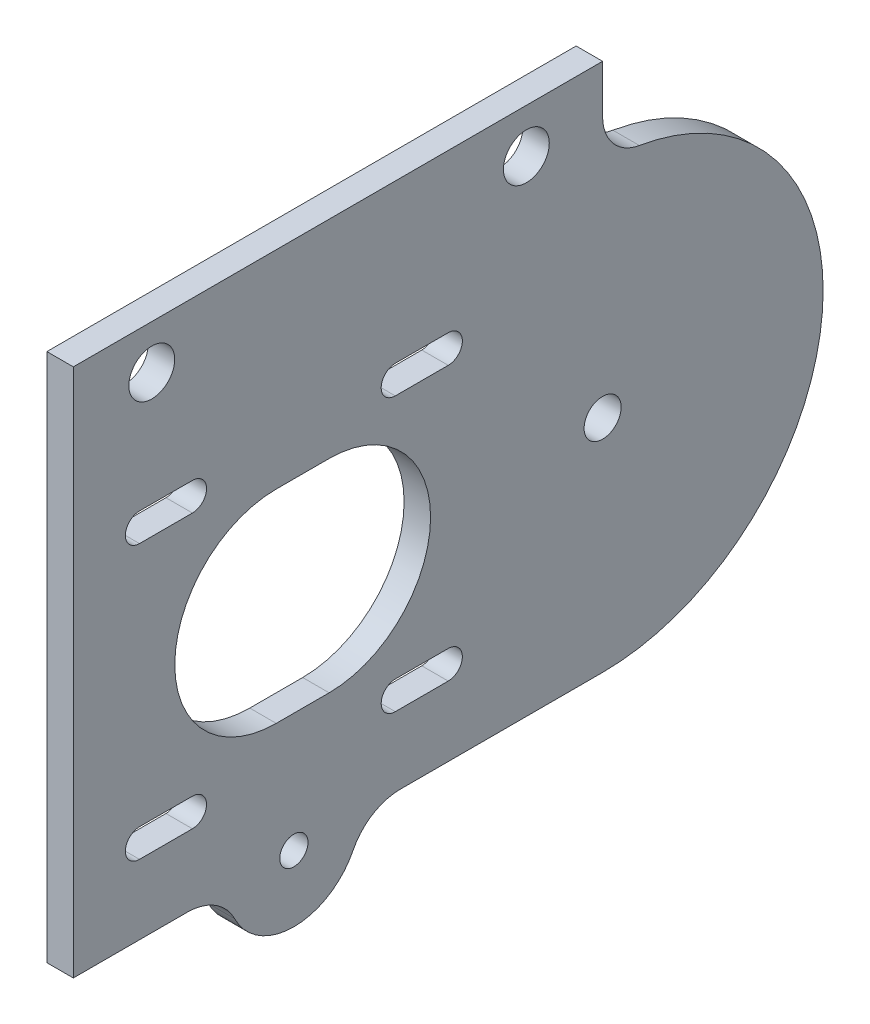
ISO-10303-21;
HEADER;
FILE_DESCRIPTION(('STEP AP214'),'2;1');
FILE_NAME('part.step','',(''),(''),'','','');
FILE_SCHEMA(('AUTOMOTIVE_DESIGN { 1 0 10303 214 1 1 1 1 }'));
ENDSEC;
DATA;
#1=APPLICATION_CONTEXT('core data for automotive mechanical design processes');
#2=APPLICATION_PROTOCOL_DEFINITION('international standard','automotive_design',2000,#1);
#3=PRODUCT_CONTEXT('',#1,'mechanical');
#4=PRODUCT('Part','Part','',(#3));
#5=PRODUCT_RELATED_PRODUCT_CATEGORY('part','',(#4));
#6=PRODUCT_DEFINITION_FORMATION('','',#4);
#7=PRODUCT_DEFINITION_CONTEXT('part definition',#1,'design');
#8=PRODUCT_DEFINITION('design','',#6,#7);
#9=PRODUCT_DEFINITION_SHAPE('','',#8);
#10=(LENGTH_UNIT() NAMED_UNIT(*) SI_UNIT(.MILLI.,.METRE.));
#11=(NAMED_UNIT(*) PLANE_ANGLE_UNIT() SI_UNIT($,.RADIAN.));
#12=(NAMED_UNIT(*) SI_UNIT($,.STERADIAN.) SOLID_ANGLE_UNIT());
#13=UNCERTAINTY_MEASURE_WITH_UNIT(LENGTH_MEASURE(1.E-05),#10,'distance_accuracy_value','');
#14=(GEOMETRIC_REPRESENTATION_CONTEXT(3) GLOBAL_UNCERTAINTY_ASSIGNED_CONTEXT((#13)) GLOBAL_UNIT_ASSIGNED_CONTEXT((#10,
#11,#12)) REPRESENTATION_CONTEXT('',''));
#15=CARTESIAN_POINT('',(0.,0.,0.));
#16=DIRECTION('',(0.,0.,1.));
#17=DIRECTION('',(1.,0.,0.));
#18=AXIS2_PLACEMENT_3D('',#15,#16,#17);
#19=CARTESIAN_POINT('',(3.,-25.,0.));
#20=DIRECTION('',(0.,1.,0.));
#21=DIRECTION('',(0.,0.,1.));
#22=AXIS2_PLACEMENT_3D('',#19,#20,#21);
#23=PLANE('',#22);
#24=DIRECTION('',(0.,0.,-1.));
#25=VECTOR('',#24,1.);
#26=CARTESIAN_POINT('',(0.,-25.,0.));
#27=LINE('',#26,#25);
#28=CARTESIAN_POINT('',(0.,-25.,25.));
#29=VERTEX_POINT('',#28);
#30=CARTESIAN_POINT('',(0.,-25.,12.0834392290772));
#31=VERTEX_POINT('',#30);
#32=EDGE_CURVE('E338',#29,#31,#27,.T.);
#33=ORIENTED_EDGE('',*,*,#32,.T.);
#34=DIRECTION('',(1.,0.,0.));
#35=VECTOR('',#34,1.);
#36=CARTESIAN_POINT('',(3.,-25.,12.0834392290772));
#37=LINE('',#36,#35);
#38=CARTESIAN_POINT('',(3.,-25.,12.0834392290772));
#39=VERTEX_POINT('',#38);
#40=EDGE_CURVE('E469',#31,#39,#37,.T.);
#41=ORIENTED_EDGE('',*,*,#40,.T.);
#42=DIRECTION('',(0.,0.,-1.));
#43=VECTOR('',#42,1.);
#44=CARTESIAN_POINT('',(3.,-25.,0.));
#45=LINE('',#44,#43);
#46=CARTESIAN_POINT('',(3.,-25.,25.));
#47=VERTEX_POINT('',#46);
#48=EDGE_CURVE('E271',#47,#39,#45,.T.);
#49=ORIENTED_EDGE('',*,*,#48,.F.);
#50=DIRECTION('',(-1.,0.,0.));
#51=VECTOR('',#50,1.);
#52=CARTESIAN_POINT('',(3.,-25.,25.));
#53=LINE('',#52,#51);
#54=EDGE_CURVE('E337',#47,#29,#53,.T.);
#55=ORIENTED_EDGE('',*,*,#54,.T.);
#56=EDGE_LOOP('',(#33,#41,#49,#55));
#57=FACE_BOUND('',#56,.T.);
#58=ADVANCED_FACE('F34',(#57),#23,.F.);
#59=CARTESIAN_POINT('',(3.,-13.9,0.));
#60=DIRECTION('',(0.,1.,0.));
#61=DIRECTION('',(0.,0.,1.));
#62=AXIS2_PLACEMENT_3D('',#59,#60,#61);
#63=PLANE('',#62);
#64=DIRECTION('',(0.,0.,-1.));
#65=VECTOR('',#64,1.);
#66=CARTESIAN_POINT('',(0.,-13.9,0.));
#67=LINE('',#66,#65);
#68=CARTESIAN_POINT('',(0.,-13.9,17.5));
#69=VERTEX_POINT('',#68);
#70=CARTESIAN_POINT('',(0.,-13.9,11.5));
#71=VERTEX_POINT('',#70);
#72=EDGE_CURVE('E392',#69,#71,#67,.T.);
#73=ORIENTED_EDGE('',*,*,#72,.T.);
#74=DIRECTION('',(-1.,0.,0.));
#75=VECTOR('',#74,1.);
#76=CARTESIAN_POINT('',(3.,-13.9,11.5));
#77=LINE('',#76,#75);
#78=CARTESIAN_POINT('',(3.,-13.9,11.5));
#79=VERTEX_POINT('',#78);
#80=EDGE_CURVE('E414',#79,#71,#77,.T.);
#81=ORIENTED_EDGE('',*,*,#80,.F.);
#82=DIRECTION('',(0.,0.,-1.));
#83=VECTOR('',#82,1.);
#84=CARTESIAN_POINT('',(3.,-13.9,0.));
#85=LINE('',#84,#83);
#86=CARTESIAN_POINT('',(3.,-13.9,17.5));
#87=VERTEX_POINT('',#86);
#88=EDGE_CURVE('E324',#87,#79,#85,.T.);
#89=ORIENTED_EDGE('',*,*,#88,.F.);
#90=DIRECTION('',(-1.,0.,0.));
#91=VECTOR('',#90,1.);
#92=CARTESIAN_POINT('',(3.,-13.9,17.5));
#93=LINE('',#92,#91);
#94=EDGE_CURVE('E406',#87,#69,#93,.T.);
#95=ORIENTED_EDGE('',*,*,#94,.T.);
#96=EDGE_LOOP('',(#73,#81,#89,#95));
#97=FACE_BOUND('',#96,.T.);
#98=ADVANCED_FACE('F512',(#97),#63,.F.);
#99=CARTESIAN_POINT('',(3.,-15.5,11.5));
#100=DIRECTION('',(-1.,0.,0.));
#101=DIRECTION('',(0.,0.,1.));
#102=AXIS2_PLACEMENT_3D('',#99,#100,#101);
#103=CYLINDRICAL_SURFACE('',#102,1.6);
#104=CARTESIAN_POINT('',(0.,-15.5,11.5));
#105=DIRECTION('',(1.,0.,0.));
#106=DIRECTION('',(0.,0.,-1.));
#107=AXIS2_PLACEMENT_3D('',#104,#105,#106);
#108=CIRCLE('',#107,1.6);
#109=CARTESIAN_POINT('',(0.,-17.1,11.5));
#110=VERTEX_POINT('',#109);
#111=EDGE_CURVE('E395',#71,#110,#108,.F.);
#112=ORIENTED_EDGE('',*,*,#111,.T.);
#113=DIRECTION('',(-1.,0.,0.));
#114=VECTOR('',#113,1.);
#115=CARTESIAN_POINT('',(3.,-17.1,11.5));
#116=LINE('',#115,#114);
#117=CARTESIAN_POINT('',(3.,-17.1,11.5));
#118=VERTEX_POINT('',#117);
#119=EDGE_CURVE('E412',#118,#110,#116,.T.);
#120=ORIENTED_EDGE('',*,*,#119,.F.);
#121=CARTESIAN_POINT('',(3.,-15.5,11.5));
#122=DIRECTION('',(1.,0.,0.));
#123=DIRECTION('',(0.,0.,-1.));
#124=AXIS2_PLACEMENT_3D('',#121,#122,#123);
#125=CIRCLE('',#124,1.6);
#126=EDGE_CURVE('E327',#79,#118,#125,.F.);
#127=ORIENTED_EDGE('',*,*,#126,.F.);
#128=ORIENTED_EDGE('',*,*,#80,.T.);
#129=EDGE_LOOP('',(#112,#120,#127,#128));
#130=FACE_BOUND('',#129,.T.);
#131=ADVANCED_FACE('F519',(#130),#103,.F.);
#132=CARTESIAN_POINT('',(3.,-17.1,0.));
#133=DIRECTION('',(0.,1.,0.));
#134=DIRECTION('',(0.,0.,1.));
#135=AXIS2_PLACEMENT_3D('',#132,#133,#134);
#136=PLANE('',#135);
#137=DIRECTION('',(0.,0.,-1.));
#138=VECTOR('',#137,1.);
#139=CARTESIAN_POINT('',(0.,-17.1,0.));
#140=LINE('',#139,#138);
#141=CARTESIAN_POINT('',(0.,-17.1,17.5));
#142=VERTEX_POINT('',#141);
#143=EDGE_CURVE('E398',#142,#110,#140,.T.);
#144=ORIENTED_EDGE('',*,*,#143,.F.);
#145=DIRECTION('',(-1.,0.,0.));
#146=VECTOR('',#145,1.);
#147=CARTESIAN_POINT('',(3.,-17.1,17.5));
#148=LINE('',#147,#146);
#149=CARTESIAN_POINT('',(3.,-17.1,17.5));
#150=VERTEX_POINT('',#149);
#151=EDGE_CURVE('E409',#150,#142,#148,.T.);
#152=ORIENTED_EDGE('',*,*,#151,.F.);
#153=DIRECTION('',(0.,0.,-1.));
#154=VECTOR('',#153,1.);
#155=CARTESIAN_POINT('',(3.,-17.1,0.));
#156=LINE('',#155,#154);
#157=EDGE_CURVE('E329',#150,#118,#156,.T.);
#158=ORIENTED_EDGE('',*,*,#157,.T.);
#159=ORIENTED_EDGE('',*,*,#119,.T.);
#160=EDGE_LOOP('',(#144,#152,#158,#159));
#161=FACE_BOUND('',#160,.T.);
#162=ADVANCED_FACE('F624',(#161),#136,.T.);
#163=CARTESIAN_POINT('',(3.,15.5,11.5));
#164=DIRECTION('',(-1.,0.,0.));
#165=DIRECTION('',(0.,0.,1.));
#166=AXIS2_PLACEMENT_3D('',#163,#164,#165);
#167=CYLINDRICAL_SURFACE('',#166,1.6);
#168=CARTESIAN_POINT('',(0.,15.5,11.5));
#169=DIRECTION('',(1.,0.,0.));
#170=DIRECTION('',(0.,0.,-1.));
#171=AXIS2_PLACEMENT_3D('',#168,#169,#170);
#172=CIRCLE('',#171,1.6);
#173=CARTESIAN_POINT('',(0.,13.9,11.5));
#174=VERTEX_POINT('',#173);
#175=CARTESIAN_POINT('',(0.,17.1,11.5));
#176=VERTEX_POINT('',#175);
#177=EDGE_CURVE('E380',#174,#176,#172,.T.);
#178=ORIENTED_EDGE('',*,*,#177,.F.);
#179=DIRECTION('',(-1.,0.,0.));
#180=VECTOR('',#179,1.);
#181=CARTESIAN_POINT('',(3.,13.9,11.5));
#182=LINE('',#181,#180);
#183=CARTESIAN_POINT('',(3.,13.9,11.5));
#184=VERTEX_POINT('',#183);
#185=EDGE_CURVE('E410',#184,#174,#182,.T.);
#186=ORIENTED_EDGE('',*,*,#185,.F.);
#187=CARTESIAN_POINT('',(3.,15.5,11.5));
#188=DIRECTION('',(1.,0.,0.));
#189=DIRECTION('',(0.,0.,-1.));
#190=AXIS2_PLACEMENT_3D('',#187,#188,#189);
#191=CIRCLE('',#190,1.6);
#192=CARTESIAN_POINT('',(3.,17.1,11.5));
#193=VERTEX_POINT('',#192);
#194=EDGE_CURVE('E313',#184,#193,#191,.T.);
#195=ORIENTED_EDGE('',*,*,#194,.T.);
#196=DIRECTION('',(-1.,0.,0.));
#197=VECTOR('',#196,1.);
#198=CARTESIAN_POINT('',(3.,17.1,11.5));
#199=LINE('',#198,#197);
#200=EDGE_CURVE('E417',#193,#176,#199,.T.);
#201=ORIENTED_EDGE('',*,*,#200,.T.);
#202=EDGE_LOOP('',(#178,#186,#195,#201));
#203=FACE_BOUND('',#202,.T.);
#204=ADVANCED_FACE('F627',(#203),#167,.F.);
#205=CARTESIAN_POINT('',(3.,13.9,0.));
#206=DIRECTION('',(0.,1.,0.));
#207=DIRECTION('',(0.,0.,1.));
#208=AXIS2_PLACEMENT_3D('',#205,#206,#207);
#209=PLANE('',#208);
#210=DIRECTION('',(0.,0.,-1.));
#211=VECTOR('',#210,1.);
#212=CARTESIAN_POINT('',(0.,13.9,0.));
#213=LINE('',#212,#211);
#214=CARTESIAN_POINT('',(0.,13.9,17.5));
#215=VERTEX_POINT('',#214);
#216=EDGE_CURVE('E383',#215,#174,#213,.T.);
#217=ORIENTED_EDGE('',*,*,#216,.F.);
#218=DIRECTION('',(-1.,0.,0.));
#219=VECTOR('',#218,1.);
#220=CARTESIAN_POINT('',(3.,13.9,17.5));
#221=LINE('',#220,#219);
#222=CARTESIAN_POINT('',(3.,13.9,17.5));
#223=VERTEX_POINT('',#222);
#224=EDGE_CURVE('E422',#223,#215,#221,.T.);
#225=ORIENTED_EDGE('',*,*,#224,.F.);
#226=DIRECTION('',(0.,0.,-1.));
#227=VECTOR('',#226,1.);
#228=CARTESIAN_POINT('',(3.,13.9,0.));
#229=LINE('',#228,#227);
#230=EDGE_CURVE('E316',#223,#184,#229,.T.);
#231=ORIENTED_EDGE('',*,*,#230,.T.);
#232=ORIENTED_EDGE('',*,*,#185,.T.);
#233=EDGE_LOOP('',(#217,#225,#231,#232));
#234=FACE_BOUND('',#233,.T.);
#235=ADVANCED_FACE('F639',(#234),#209,.T.);
#236=CARTESIAN_POINT('',(3.,15.5,17.5));
#237=DIRECTION('',(-1.,0.,0.));
#238=DIRECTION('',(0.,0.,1.));
#239=AXIS2_PLACEMENT_3D('',#236,#237,#238);
#240=CYLINDRICAL_SURFACE('',#239,1.6);
#241=CARTESIAN_POINT('',(0.,15.5,17.5));
#242=DIRECTION('',(1.,0.,0.));
#243=DIRECTION('',(0.,0.,-1.));
#244=AXIS2_PLACEMENT_3D('',#241,#242,#243);
#245=CIRCLE('',#244,1.6);
#246=CARTESIAN_POINT('',(0.,17.1,17.5));
#247=VERTEX_POINT('',#246);
#248=EDGE_CURVE('E386',#247,#215,#245,.T.);
#249=ORIENTED_EDGE('',*,*,#248,.F.);
#250=DIRECTION('',(-1.,0.,0.));
#251=VECTOR('',#250,1.);
#252=CARTESIAN_POINT('',(3.,17.1,17.5));
#253=LINE('',#252,#251);
#254=CARTESIAN_POINT('',(3.,17.1,17.5));
#255=VERTEX_POINT('',#254);
#256=EDGE_CURVE('E419',#255,#247,#253,.T.);
#257=ORIENTED_EDGE('',*,*,#256,.F.);
#258=CARTESIAN_POINT('',(3.,15.5,17.5));
#259=DIRECTION('',(1.,0.,0.));
#260=DIRECTION('',(0.,0.,-1.));
#261=AXIS2_PLACEMENT_3D('',#258,#259,#260);
#262=CIRCLE('',#261,1.6);
#263=EDGE_CURVE('E319',#255,#223,#262,.T.);
#264=ORIENTED_EDGE('',*,*,#263,.T.);
#265=ORIENTED_EDGE('',*,*,#224,.T.);
#266=EDGE_LOOP('',(#249,#257,#264,#265));
#267=FACE_BOUND('',#266,.T.);
#268=ADVANCED_FACE('F635',(#267),#240,.F.);
#269=CARTESIAN_POINT('',(3.,-15.5,-17.5));
#270=DIRECTION('',(-1.,0.,0.));
#271=DIRECTION('',(0.,0.,1.));
#272=AXIS2_PLACEMENT_3D('',#269,#270,#271);
#273=CYLINDRICAL_SURFACE('',#272,1.6);
#274=CARTESIAN_POINT('',(0.,-15.5,-17.5));
#275=DIRECTION('',(1.,0.,0.));
#276=DIRECTION('',(0.,0.,-1.));
#277=AXIS2_PLACEMENT_3D('',#274,#275,#276);
#278=CIRCLE('',#277,1.6);
#279=CARTESIAN_POINT('',(0.,-17.1,-17.5));
#280=VERTEX_POINT('',#279);
#281=CARTESIAN_POINT('',(0.,-13.9,-17.5));
#282=VERTEX_POINT('',#281);
#283=EDGE_CURVE('E368',#280,#282,#278,.T.);
#284=ORIENTED_EDGE('',*,*,#283,.F.);
#285=DIRECTION('',(-1.,0.,0.));
#286=VECTOR('',#285,1.);
#287=CARTESIAN_POINT('',(3.,-17.1,-17.5));
#288=LINE('',#287,#286);
#289=CARTESIAN_POINT('',(3.,-17.1,-17.5));
#290=VERTEX_POINT('',#289);
#291=EDGE_CURVE('E420',#290,#280,#288,.T.);
#292=ORIENTED_EDGE('',*,*,#291,.F.);
#293=CARTESIAN_POINT('',(3.,-15.5,-17.5));
#294=DIRECTION('',(1.,0.,0.));
#295=DIRECTION('',(0.,0.,-1.));
#296=AXIS2_PLACEMENT_3D('',#293,#294,#295);
#297=CIRCLE('',#296,1.6);
#298=CARTESIAN_POINT('',(3.,-13.9,-17.5));
#299=VERTEX_POINT('',#298);
#300=EDGE_CURVE('E302',#290,#299,#297,.T.);
#301=ORIENTED_EDGE('',*,*,#300,.T.);
#302=DIRECTION('',(-1.,0.,0.));
#303=VECTOR('',#302,1.);
#304=CARTESIAN_POINT('',(3.,-13.9,-17.5));
#305=LINE('',#304,#303);
#306=EDGE_CURVE('E425',#299,#282,#305,.T.);
#307=ORIENTED_EDGE('',*,*,#306,.T.);
#308=EDGE_LOOP('',(#284,#292,#301,#307));
#309=FACE_BOUND('',#308,.T.);
#310=ADVANCED_FACE('F638',(#309),#273,.F.);
#311=CARTESIAN_POINT('',(3.,-17.1,0.));
#312=DIRECTION('',(0.,-1.,0.));
#313=DIRECTION('',(0.,0.,-1.));
#314=AXIS2_PLACEMENT_3D('',#311,#312,#313);
#315=PLANE('',#314);
#316=DIRECTION('',(0.,0.,1.));
#317=VECTOR('',#316,1.);
#318=CARTESIAN_POINT('',(0.,-17.1,0.));
#319=LINE('',#318,#317);
#320=CARTESIAN_POINT('',(0.,-17.1,-11.5));
#321=VERTEX_POINT('',#320);
#322=EDGE_CURVE('E371',#280,#321,#319,.T.);
#323=ORIENTED_EDGE('',*,*,#322,.T.);
#324=DIRECTION('',(-1.,0.,0.));
#325=VECTOR('',#324,1.);
#326=CARTESIAN_POINT('',(3.,-17.1,-11.5));
#327=LINE('',#326,#325);
#328=CARTESIAN_POINT('',(3.,-17.1,-11.5));
#329=VERTEX_POINT('',#328);
#330=EDGE_CURVE('E430',#329,#321,#327,.T.);
#331=ORIENTED_EDGE('',*,*,#330,.F.);
#332=DIRECTION('',(0.,0.,1.));
#333=VECTOR('',#332,1.);
#334=CARTESIAN_POINT('',(3.,-17.1,0.));
#335=LINE('',#334,#333);
#336=EDGE_CURVE('E305',#290,#329,#335,.T.);
#337=ORIENTED_EDGE('',*,*,#336,.F.);
#338=ORIENTED_EDGE('',*,*,#291,.T.);
#339=EDGE_LOOP('',(#323,#331,#337,#338));
#340=FACE_BOUND('',#339,.T.);
#341=ADVANCED_FACE('F654',(#340),#315,.F.);
#342=CARTESIAN_POINT('',(3.,-15.5,-11.5));
#343=DIRECTION('',(-1.,0.,0.));
#344=DIRECTION('',(0.,0.,1.));
#345=AXIS2_PLACEMENT_3D('',#342,#343,#344);
#346=CYLINDRICAL_SURFACE('',#345,1.6);
#347=CARTESIAN_POINT('',(0.,-15.5,-11.5));
#348=DIRECTION('',(1.,0.,0.));
#349=DIRECTION('',(0.,0.,-1.));
#350=AXIS2_PLACEMENT_3D('',#347,#348,#349);
#351=CIRCLE('',#350,1.6);
#352=CARTESIAN_POINT('',(0.,-13.9,-11.5));
#353=VERTEX_POINT('',#352);
#354=EDGE_CURVE('E374',#353,#321,#351,.T.);
#355=ORIENTED_EDGE('',*,*,#354,.F.);
#356=DIRECTION('',(-1.,0.,0.));
#357=VECTOR('',#356,1.);
#358=CARTESIAN_POINT('',(3.,-13.9,-11.5));
#359=LINE('',#358,#357);
#360=CARTESIAN_POINT('',(3.,-13.9,-11.5));
#361=VERTEX_POINT('',#360);
#362=EDGE_CURVE('E427',#361,#353,#359,.T.);
#363=ORIENTED_EDGE('',*,*,#362,.F.);
#364=CARTESIAN_POINT('',(3.,-15.5,-11.5));
#365=DIRECTION('',(1.,0.,0.));
#366=DIRECTION('',(0.,0.,-1.));
#367=AXIS2_PLACEMENT_3D('',#364,#365,#366);
#368=CIRCLE('',#367,1.6);
#369=EDGE_CURVE('E307',#361,#329,#368,.T.);
#370=ORIENTED_EDGE('',*,*,#369,.T.);
#371=ORIENTED_EDGE('',*,*,#330,.T.);
#372=EDGE_LOOP('',(#355,#363,#370,#371));
#373=FACE_BOUND('',#372,.T.);
#374=ADVANCED_FACE('F650',(#373),#346,.F.);
#375=CARTESIAN_POINT('',(3.,17.1,0.));
#376=DIRECTION('',(0.,-1.,0.));
#377=DIRECTION('',(0.,0.,-1.));
#378=AXIS2_PLACEMENT_3D('',#375,#376,#377);
#379=PLANE('',#378);
#380=DIRECTION('',(0.,0.,1.));
#381=VECTOR('',#380,1.);
#382=CARTESIAN_POINT('',(0.,17.1,0.));
#383=LINE('',#382,#381);
#384=CARTESIAN_POINT('',(0.,17.1,-17.5));
#385=VERTEX_POINT('',#384);
#386=CARTESIAN_POINT('',(0.,17.1,-11.5));
#387=VERTEX_POINT('',#386);
#388=EDGE_CURVE('E356',#385,#387,#383,.T.);
#389=ORIENTED_EDGE('',*,*,#388,.F.);
#390=DIRECTION('',(-1.,0.,0.));
#391=VECTOR('',#390,1.);
#392=CARTESIAN_POINT('',(3.,17.1,-17.5));
#393=LINE('',#392,#391);
#394=CARTESIAN_POINT('',(3.,17.1,-17.5));
#395=VERTEX_POINT('',#394);
#396=EDGE_CURVE('E428',#395,#385,#393,.T.);
#397=ORIENTED_EDGE('',*,*,#396,.F.);
#398=DIRECTION('',(0.,0.,1.));
#399=VECTOR('',#398,1.);
#400=CARTESIAN_POINT('',(3.,17.1,0.));
#401=LINE('',#400,#399);
#402=CARTESIAN_POINT('',(3.,17.1,-11.5));
#403=VERTEX_POINT('',#402);
#404=EDGE_CURVE('E291',#395,#403,#401,.T.);
#405=ORIENTED_EDGE('',*,*,#404,.T.);
#406=DIRECTION('',(-1.,0.,0.));
#407=VECTOR('',#406,1.);
#408=CARTESIAN_POINT('',(3.,17.1,-11.5));
#409=LINE('',#408,#407);
#410=EDGE_CURVE('E433',#403,#387,#409,.T.);
#411=ORIENTED_EDGE('',*,*,#410,.T.);
#412=EDGE_LOOP('',(#389,#397,#405,#411));
#413=FACE_BOUND('',#412,.T.);
#414=ADVANCED_FACE('F653',(#413),#379,.T.);
#415=CARTESIAN_POINT('',(3.,15.5,-17.5));
#416=DIRECTION('',(-1.,0.,0.));
#417=DIRECTION('',(0.,0.,1.));
#418=AXIS2_PLACEMENT_3D('',#415,#416,#417);
#419=CYLINDRICAL_SURFACE('',#418,1.6);
#420=CARTESIAN_POINT('',(0.,15.5,-17.5));
#421=DIRECTION('',(1.,0.,0.));
#422=DIRECTION('',(0.,0.,-1.));
#423=AXIS2_PLACEMENT_3D('',#420,#421,#422);
#424=CIRCLE('',#423,1.6);
#425=CARTESIAN_POINT('',(0.,13.9,-17.5));
#426=VERTEX_POINT('',#425);
#427=EDGE_CURVE('E359',#385,#426,#424,.F.);
#428=ORIENTED_EDGE('',*,*,#427,.T.);
#429=DIRECTION('',(-1.,0.,0.));
#430=VECTOR('',#429,1.);
#431=CARTESIAN_POINT('',(3.,13.9,-17.5));
#432=LINE('',#431,#430);
#433=CARTESIAN_POINT('',(3.,13.9,-17.5));
#434=VERTEX_POINT('',#433);
#435=EDGE_CURVE('E439',#434,#426,#432,.T.);
#436=ORIENTED_EDGE('',*,*,#435,.F.);
#437=CARTESIAN_POINT('',(3.,15.5,-17.5));
#438=DIRECTION('',(1.,0.,0.));
#439=DIRECTION('',(0.,0.,-1.));
#440=AXIS2_PLACEMENT_3D('',#437,#438,#439);
#441=CIRCLE('',#440,1.6);
#442=EDGE_CURVE('E294',#395,#434,#441,.F.);
#443=ORIENTED_EDGE('',*,*,#442,.F.);
#444=ORIENTED_EDGE('',*,*,#396,.T.);
#445=EDGE_LOOP('',(#428,#436,#443,#444));
#446=FACE_BOUND('',#445,.T.);
#447=ADVANCED_FACE('F664',(#446),#419,.F.);
#448=CARTESIAN_POINT('',(3.,13.9,0.));
#449=DIRECTION('',(0.,-1.,0.));
#450=DIRECTION('',(0.,0.,-1.));
#451=AXIS2_PLACEMENT_3D('',#448,#449,#450);
#452=PLANE('',#451);
#453=DIRECTION('',(0.,0.,1.));
#454=VECTOR('',#453,1.);
#455=CARTESIAN_POINT('',(0.,13.9,0.));
#456=LINE('',#455,#454);
#457=CARTESIAN_POINT('',(0.,13.9,-11.5));
#458=VERTEX_POINT('',#457);
#459=EDGE_CURVE('E362',#426,#458,#456,.T.);
#460=ORIENTED_EDGE('',*,*,#459,.T.);
#461=DIRECTION('',(-1.,0.,0.));
#462=VECTOR('',#461,1.);
#463=CARTESIAN_POINT('',(3.,13.9,-11.5));
#464=LINE('',#463,#462);
#465=CARTESIAN_POINT('',(3.,13.9,-11.5));
#466=VERTEX_POINT('',#465);
#467=EDGE_CURVE('E435',#466,#458,#464,.T.);
#468=ORIENTED_EDGE('',*,*,#467,.F.);
#469=DIRECTION('',(0.,0.,1.));
#470=VECTOR('',#469,1.);
#471=CARTESIAN_POINT('',(3.,13.9,0.));
#472=LINE('',#471,#470);
#473=EDGE_CURVE('E297',#434,#466,#472,.T.);
#474=ORIENTED_EDGE('',*,*,#473,.F.);
#475=ORIENTED_EDGE('',*,*,#435,.T.);
#476=EDGE_LOOP('',(#460,#468,#474,#475));
#477=FACE_BOUND('',#476,.T.);
#478=ADVANCED_FACE('F546',(#477),#452,.F.);
#479=CARTESIAN_POINT('',(3.,0.,-4.));
#480=DIRECTION('',(-1.,0.,0.));
#481=DIRECTION('',(0.,0.,1.));
#482=AXIS2_PLACEMENT_3D('',#479,#480,#481);
#483=CYLINDRICAL_SURFACE('',#482,11.5);
#484=CARTESIAN_POINT('',(0.,0.,-4.));
#485=DIRECTION('',(1.,0.,0.));
#486=DIRECTION('',(0.,0.,-1.));
#487=AXIS2_PLACEMENT_3D('',#484,#485,#486);
#488=CIRCLE('',#487,11.5);
#489=CARTESIAN_POINT('',(0.,-11.5,-4.));
#490=VERTEX_POINT('',#489);
#491=CARTESIAN_POINT('',(0.,11.5,-4.));
#492=VERTEX_POINT('',#491);
#493=EDGE_CURVE('E344',#490,#492,#488,.T.);
#494=ORIENTED_EDGE('',*,*,#493,.F.);
#495=DIRECTION('',(-1.,0.,0.));
#496=VECTOR('',#495,1.);
#497=CARTESIAN_POINT('',(3.,-11.5,-4.));
#498=LINE('',#497,#496);
#499=CARTESIAN_POINT('',(3.,-11.5,-4.));
#500=VERTEX_POINT('',#499);
#501=EDGE_CURVE('E436',#500,#490,#498,.T.);
#502=ORIENTED_EDGE('',*,*,#501,.F.);
#503=CARTESIAN_POINT('',(3.,0.,-4.));
#504=DIRECTION('',(1.,0.,0.));
#505=DIRECTION('',(0.,0.,-1.));
#506=AXIS2_PLACEMENT_3D('',#503,#504,#505);
#507=CIRCLE('',#506,11.5);
#508=CARTESIAN_POINT('',(3.,11.5,-4.));
#509=VERTEX_POINT('',#508);
#510=EDGE_CURVE('E280',#500,#509,#507,.T.);
#511=ORIENTED_EDGE('',*,*,#510,.T.);
#512=DIRECTION('',(-1.,0.,0.));
#513=VECTOR('',#512,1.);
#514=CARTESIAN_POINT('',(3.,11.5,-4.));
#515=LINE('',#514,#513);
#516=EDGE_CURVE('E443',#509,#492,#515,.T.);
#517=ORIENTED_EDGE('',*,*,#516,.T.);
#518=EDGE_LOOP('',(#494,#502,#511,#517));
#519=FACE_BOUND('',#518,.T.);
#520=ADVANCED_FACE('F536',(#519),#483,.F.);
#521=CARTESIAN_POINT('',(3.,-11.5,0.));
#522=DIRECTION('',(0.,1.,0.));
#523=DIRECTION('',(0.,0.,1.));
#524=AXIS2_PLACEMENT_3D('',#521,#522,#523);
#525=PLANE('',#524);
#526=DIRECTION('',(0.,0.,-1.));
#527=VECTOR('',#526,1.);
#528=CARTESIAN_POINT('',(0.,-11.5,0.));
#529=LINE('',#528,#527);
#530=CARTESIAN_POINT('',(0.,-11.5,2.));
#531=VERTEX_POINT('',#530);
#532=EDGE_CURVE('E347',#531,#490,#529,.T.);
#533=ORIENTED_EDGE('',*,*,#532,.F.);
#534=DIRECTION('',(-1.,0.,0.));
#535=VECTOR('',#534,1.);
#536=CARTESIAN_POINT('',(3.,-11.5,2.));
#537=LINE('',#536,#535);
#538=CARTESIAN_POINT('',(3.,-11.5,2.));
#539=VERTEX_POINT('',#538);
#540=EDGE_CURVE('E448',#539,#531,#537,.T.);
#541=ORIENTED_EDGE('',*,*,#540,.F.);
#542=DIRECTION('',(0.,0.,-1.));
#543=VECTOR('',#542,1.);
#544=CARTESIAN_POINT('',(3.,-11.5,0.));
#545=LINE('',#544,#543);
#546=EDGE_CURVE('E283',#539,#500,#545,.T.);
#547=ORIENTED_EDGE('',*,*,#546,.T.);
#548=ORIENTED_EDGE('',*,*,#501,.T.);
#549=EDGE_LOOP('',(#533,#541,#547,#548));
#550=FACE_BOUND('',#549,.T.);
#551=ADVANCED_FACE('F530',(#550),#525,.T.);
#552=CARTESIAN_POINT('',(3.,0.,2.));
#553=DIRECTION('',(-1.,0.,0.));
#554=DIRECTION('',(0.,0.,1.));
#555=AXIS2_PLACEMENT_3D('',#552,#553,#554);
#556=CYLINDRICAL_SURFACE('',#555,11.5);
#557=CARTESIAN_POINT('',(0.,0.,2.));
#558=DIRECTION('',(1.,0.,0.));
#559=DIRECTION('',(0.,0.,-1.));
#560=AXIS2_PLACEMENT_3D('',#557,#558,#559);
#561=CIRCLE('',#560,11.5);
#562=CARTESIAN_POINT('',(0.,11.5,2.));
#563=VERTEX_POINT('',#562);
#564=EDGE_CURVE('E350',#563,#531,#561,.T.);
#565=ORIENTED_EDGE('',*,*,#564,.F.);
#566=DIRECTION('',(-1.,0.,0.));
#567=VECTOR('',#566,1.);
#568=CARTESIAN_POINT('',(3.,11.5,2.));
#569=LINE('',#568,#567);
#570=CARTESIAN_POINT('',(3.,11.5,2.));
#571=VERTEX_POINT('',#570);
#572=EDGE_CURVE('E445',#571,#563,#569,.T.);
#573=ORIENTED_EDGE('',*,*,#572,.F.);
#574=CARTESIAN_POINT('',(3.,0.,2.));
#575=DIRECTION('',(1.,0.,0.));
#576=DIRECTION('',(0.,0.,-1.));
#577=AXIS2_PLACEMENT_3D('',#574,#575,#576);
#578=CIRCLE('',#577,11.5);
#579=EDGE_CURVE('E286',#571,#539,#578,.T.);
#580=ORIENTED_EDGE('',*,*,#579,.T.);
#581=ORIENTED_EDGE('',*,*,#540,.T.);
#582=EDGE_LOOP('',(#565,#573,#580,#581));
#583=FACE_BOUND('',#582,.T.);
#584=ADVANCED_FACE('F523',(#583),#556,.F.);
#585=CARTESIAN_POINT('',(3.,-25.,-12.0834392290772));
#586=VERTEX_POINT('',#585);
#587=CARTESIAN_POINT('',(3.,-25.,-35.));
#588=VERTEX_POINT('',#587);
#589=EDGE_CURVE('E275',#586,#588,#45,.T.);
#590=ORIENTED_EDGE('',*,*,#589,.F.);
#591=DIRECTION('',(1.,0.,0.));
#592=VECTOR('',#591,1.);
#593=CARTESIAN_POINT('',(3.,-25.,-12.0834392290772));
#594=LINE('',#593,#592);
#595=CARTESIAN_POINT('',(0.,-25.,-12.0834392290772));
#596=VERTEX_POINT('',#595);
#597=EDGE_CURVE('E462',#586,#596,#594,.F.);
#598=ORIENTED_EDGE('',*,*,#597,.T.);
#599=CARTESIAN_POINT('',(0.,-25.,-35.));
#600=VERTEX_POINT('',#599);
#601=EDGE_CURVE('E268',#596,#600,#27,.T.);
#602=ORIENTED_EDGE('',*,*,#601,.T.);
#603=DIRECTION('',(-1.,0.,0.));
#604=VECTOR('',#603,1.);
#605=CARTESIAN_POINT('',(3.,-25.,-35.));
#606=LINE('',#605,#604);
#607=EDGE_CURVE('E446',#588,#600,#606,.T.);
#608=ORIENTED_EDGE('',*,*,#607,.F.);
#609=EDGE_LOOP('',(#590,#598,#602,#608));
#610=FACE_BOUND('',#609,.T.);
#611=ADVANCED_FACE('F498',(#610),#23,.F.);
#612=CARTESIAN_POINT('',(3.,0.,-35.));
#613=DIRECTION('',(-1.,0.,0.));
#614=DIRECTION('',(0.,0.,1.));
#615=AXIS2_PLACEMENT_3D('',#612,#613,#614);
#616=CYLINDRICAL_SURFACE('',#615,25.);
#617=CARTESIAN_POINT('',(0.,0.,-35.));
#618=DIRECTION('',(1.,0.,0.));
#619=DIRECTION('',(0.,0.,-1.));
#620=AXIS2_PLACEMENT_3D('',#617,#618,#619);
#621=CIRCLE('',#620,25.);
#622=CARTESIAN_POINT('',(0.,24.6503324295817,-39.1666666666666));
#623=VERTEX_POINT('',#622);
#624=EDGE_CURVE('E340',#600,#623,#621,.T.);
#625=ORIENTED_EDGE('',*,*,#624,.T.);
#626=DIRECTION('',(-1.,0.,0.));
#627=VECTOR('',#626,1.);
#628=CARTESIAN_POINT('',(3.,24.6503324295818,-39.1666666666666));
#629=LINE('',#628,#627);
#630=CARTESIAN_POINT('',(3.,24.6503324295817,-39.1666666666666));
#631=VERTEX_POINT('',#630);
#632=EDGE_CURVE('E456',#623,#631,#629,.F.);
#633=ORIENTED_EDGE('',*,*,#632,.T.);
#634=CARTESIAN_POINT('',(3.,0.,-35.));
#635=DIRECTION('',(1.,0.,0.));
#636=DIRECTION('',(0.,0.,-1.));
#637=AXIS2_PLACEMENT_3D('',#634,#635,#636);
#638=CIRCLE('',#637,25.);
#639=EDGE_CURVE('E274',#588,#631,#638,.T.);
#640=ORIENTED_EDGE('',*,*,#639,.F.);
#641=ORIENTED_EDGE('',*,*,#607,.T.);
#642=EDGE_LOOP('',(#625,#633,#640,#641));
#643=FACE_BOUND('',#642,.T.);
#644=ADVANCED_FACE('F493',(#643),#616,.T.);
#645=CARTESIAN_POINT('',(3.,-15.5,17.5));
#646=DIRECTION('',(-1.,0.,0.));
#647=DIRECTION('',(0.,0.,1.));
#648=AXIS2_PLACEMENT_3D('',#645,#646,#647);
#649=CYLINDRICAL_SURFACE('',#648,1.6);
#650=CARTESIAN_POINT('',(0.,-15.5,17.5));
#651=DIRECTION('',(1.,0.,0.));
#652=DIRECTION('',(0.,0.,-1.));
#653=AXIS2_PLACEMENT_3D('',#650,#651,#652);
#654=CIRCLE('',#653,1.6);
#655=EDGE_CURVE('E401',#142,#69,#654,.F.);
#656=ORIENTED_EDGE('',*,*,#655,.T.);
#657=ORIENTED_EDGE('',*,*,#94,.F.);
#658=CARTESIAN_POINT('',(3.,-15.5,17.5));
#659=DIRECTION('',(1.,0.,0.));
#660=DIRECTION('',(0.,0.,-1.));
#661=AXIS2_PLACEMENT_3D('',#658,#659,#660);
#662=CIRCLE('',#661,1.6);
#663=EDGE_CURVE('E332',#150,#87,#662,.F.);
#664=ORIENTED_EDGE('',*,*,#663,.F.);
#665=ORIENTED_EDGE('',*,*,#151,.T.);
#666=EDGE_LOOP('',(#656,#657,#664,#665));
#667=FACE_BOUND('',#666,.T.);
#668=ADVANCED_FACE('F528',(#667),#649,.F.);
#669=CARTESIAN_POINT('',(3.,17.1,0.));
#670=DIRECTION('',(0.,1.,0.));
#671=DIRECTION('',(0.,0.,1.));
#672=AXIS2_PLACEMENT_3D('',#669,#670,#671);
#673=PLANE('',#672);
#674=DIRECTION('',(0.,0.,-1.));
#675=VECTOR('',#674,1.);
#676=CARTESIAN_POINT('',(0.,17.1,0.));
#677=LINE('',#676,#675);
#678=EDGE_CURVE('E389',#247,#176,#677,.T.);
#679=ORIENTED_EDGE('',*,*,#678,.T.);
#680=ORIENTED_EDGE('',*,*,#200,.F.);
#681=DIRECTION('',(0.,0.,-1.));
#682=VECTOR('',#681,1.);
#683=CARTESIAN_POINT('',(3.,17.1,0.));
#684=LINE('',#683,#682);
#685=EDGE_CURVE('E322',#255,#193,#684,.T.);
#686=ORIENTED_EDGE('',*,*,#685,.F.);
#687=ORIENTED_EDGE('',*,*,#256,.T.);
#688=EDGE_LOOP('',(#679,#680,#686,#687));
#689=FACE_BOUND('',#688,.T.);
#690=ADVANCED_FACE('F622',(#689),#673,.F.);
#691=CARTESIAN_POINT('',(3.,-13.9,0.));
#692=DIRECTION('',(0.,-1.,0.));
#693=DIRECTION('',(0.,0.,-1.));
#694=AXIS2_PLACEMENT_3D('',#691,#692,#693);
#695=PLANE('',#694);
#696=DIRECTION('',(0.,0.,1.));
#697=VECTOR('',#696,1.);
#698=CARTESIAN_POINT('',(0.,-13.9,0.));
#699=LINE('',#698,#697);
#700=EDGE_CURVE('E377',#282,#353,#699,.T.);
#701=ORIENTED_EDGE('',*,*,#700,.F.);
#702=ORIENTED_EDGE('',*,*,#306,.F.);
#703=DIRECTION('',(0.,0.,1.));
#704=VECTOR('',#703,1.);
#705=CARTESIAN_POINT('',(3.,-13.9,0.));
#706=LINE('',#705,#704);
#707=EDGE_CURVE('E310',#299,#361,#706,.T.);
#708=ORIENTED_EDGE('',*,*,#707,.T.);
#709=ORIENTED_EDGE('',*,*,#362,.T.);
#710=EDGE_LOOP('',(#701,#702,#708,#709));
#711=FACE_BOUND('',#710,.T.);
#712=ADVANCED_FACE('F561',(#711),#695,.T.);
#713=CARTESIAN_POINT('',(3.,15.5,-11.5));
#714=DIRECTION('',(-1.,0.,0.));
#715=DIRECTION('',(0.,0.,1.));
#716=AXIS2_PLACEMENT_3D('',#713,#714,#715);
#717=CYLINDRICAL_SURFACE('',#716,1.6);
#718=CARTESIAN_POINT('',(0.,15.5,-11.5));
#719=DIRECTION('',(1.,0.,0.));
#720=DIRECTION('',(0.,0.,-1.));
#721=AXIS2_PLACEMENT_3D('',#718,#719,#720);
#722=CIRCLE('',#721,1.6);
#723=EDGE_CURVE('E365',#458,#387,#722,.F.);
#724=ORIENTED_EDGE('',*,*,#723,.T.);
#725=ORIENTED_EDGE('',*,*,#410,.F.);
#726=CARTESIAN_POINT('',(3.,15.5,-11.5));
#727=DIRECTION('',(1.,0.,0.));
#728=DIRECTION('',(0.,0.,-1.));
#729=AXIS2_PLACEMENT_3D('',#726,#727,#728);
#730=CIRCLE('',#729,1.6);
#731=EDGE_CURVE('E300',#466,#403,#730,.F.);
#732=ORIENTED_EDGE('',*,*,#731,.F.);
#733=ORIENTED_EDGE('',*,*,#467,.T.);
#734=EDGE_LOOP('',(#724,#725,#732,#733));
#735=FACE_BOUND('',#734,.T.);
#736=ADVANCED_FACE('F556',(#735),#717,.F.);
#737=CARTESIAN_POINT('',(3.,11.5,0.));
#738=DIRECTION('',(0.,1.,0.));
#739=DIRECTION('',(0.,0.,1.));
#740=AXIS2_PLACEMENT_3D('',#737,#738,#739);
#741=PLANE('',#740);
#742=DIRECTION('',(0.,0.,-1.));
#743=VECTOR('',#742,1.);
#744=CARTESIAN_POINT('',(0.,11.5,0.));
#745=LINE('',#744,#743);
#746=EDGE_CURVE('E353',#563,#492,#745,.T.);
#747=ORIENTED_EDGE('',*,*,#746,.T.);
#748=ORIENTED_EDGE('',*,*,#516,.F.);
#749=DIRECTION('',(0.,0.,-1.));
#750=VECTOR('',#749,1.);
#751=CARTESIAN_POINT('',(3.,11.5,0.));
#752=LINE('',#751,#750);
#753=EDGE_CURVE('E289',#571,#509,#752,.T.);
#754=ORIENTED_EDGE('',*,*,#753,.F.);
#755=ORIENTED_EDGE('',*,*,#572,.T.);
#756=EDGE_LOOP('',(#747,#748,#754,#755));
#757=FACE_BOUND('',#756,.T.);
#758=ADVANCED_FACE('F541',(#757),#741,.F.);
#759=CARTESIAN_POINT('',(3.,0.,25.));
#760=DIRECTION('',(0.,0.,-1.));
#761=DIRECTION('',(-1.,0.,0.));
#762=AXIS2_PLACEMENT_3D('',#759,#760,#761);
#763=PLANE('',#762);
#764=DIRECTION('',(0.,-1.,0.));
#765=VECTOR('',#764,1.);
#766=CARTESIAN_POINT('',(0.,0.,25.));
#767=LINE('',#766,#765);
#768=CARTESIAN_POINT('',(0.,35.,25.));
#769=VERTEX_POINT('',#768);
#770=EDGE_CURVE('E254',#769,#29,#767,.T.);
#771=ORIENTED_EDGE('',*,*,#770,.T.);
#772=ORIENTED_EDGE('',*,*,#54,.F.);
#773=DIRECTION('',(0.,-1.,0.));
#774=VECTOR('',#773,1.);
#775=CARTESIAN_POINT('',(3.,0.,25.));
#776=LINE('',#775,#774);
#777=CARTESIAN_POINT('',(3.,35.,25.));
#778=VERTEX_POINT('',#777);
#779=EDGE_CURVE('E278',#778,#47,#776,.T.);
#780=ORIENTED_EDGE('',*,*,#779,.F.);
#781=DIRECTION('',(1.,0.,0.));
#782=VECTOR('',#781,1.);
#783=CARTESIAN_POINT('',(0.,35.,25.));
#784=LINE('',#783,#782);
#785=EDGE_CURVE('E249',#769,#778,#784,.T.);
#786=ORIENTED_EDGE('',*,*,#785,.F.);
#787=EDGE_LOOP('',(#771,#772,#780,#786));
#788=FACE_BOUND('',#787,.T.);
#789=ADVANCED_FACE('F486',(#788),#763,.F.);
#790=CARTESIAN_POINT('',(3.,0.,-35.));
#791=DIRECTION('',(-1.,0.,0.));
#792=DIRECTION('',(0.,0.,1.));
#793=AXIS2_PLACEMENT_3D('',#790,#791,#792);
#794=CYLINDRICAL_SURFACE('',#793,2.1);
#795=CARTESIAN_POINT('',(3.,0.,-35.));
#796=DIRECTION('',(1.,0.,0.));
#797=DIRECTION('',(0.,0.,-1.));
#798=AXIS2_PLACEMENT_3D('',#795,#796,#797);
#799=CIRCLE('',#798,2.1);
#800=CARTESIAN_POINT('',(3.,0.,-37.1));
#801=VERTEX_POINT('',#800);
#802=EDGE_CURVE('E334',#801,#801,#799,.T.);
#803=ORIENTED_EDGE('',*,*,#802,.T.);
#804=EDGE_LOOP('',(#803));
#805=FACE_BOUND('',#804,.T.);
#806=CARTESIAN_POINT('',(0.,0.,-35.));
#807=DIRECTION('',(1.,0.,0.));
#808=DIRECTION('',(0.,0.,-1.));
#809=AXIS2_PLACEMENT_3D('',#806,#807,#808);
#810=CIRCLE('',#809,2.1);
#811=CARTESIAN_POINT('',(0.,0.,-37.1));
#812=VERTEX_POINT('',#811);
#813=EDGE_CURVE('E403',#812,#812,#810,.T.);
#814=ORIENTED_EDGE('',*,*,#813,.F.);
#815=EDGE_LOOP('',(#814));
#816=FACE_BOUND('',#815,.T.);
#817=ADVANCED_FACE('F549',(#805,#816),#794,.F.);
#818=CARTESIAN_POINT('',(3.,0.,0.));
#819=DIRECTION('',(1.,0.,0.));
#820=DIRECTION('',(0.,0.,-1.));
#821=AXIS2_PLACEMENT_3D('',#818,#819,#820);
#822=PLANE('',#821);
#823=CARTESIAN_POINT('',(3.,-24.9799919935936,0.));
#824=DIRECTION('',(-1.,0.,0.));
#825=DIRECTION('',(0.,0.,1.));
#826=AXIS2_PLACEMENT_3D('',#823,#824,#825);
#827=CIRCLE('',#826,1.6);
#828=CARTESIAN_POINT('',(3.,-24.9799919935936,1.60000000000001));
#829=VERTEX_POINT('',#828);
#830=EDGE_CURVE('E603',#829,#829,#827,.T.);
#831=ORIENTED_EDGE('',*,*,#830,.T.);
#832=EDGE_LOOP('',(#831));
#833=FACE_BOUND('',#832,.T.);
#834=ORIENTED_EDGE('',*,*,#48,.T.);
#835=CARTESIAN_POINT('',(3.,-31.,12.0834392290772));
#836=DIRECTION('',(1.,0.,0.));
#837=DIRECTION('',(0.,0.,-1.));
#838=AXIS2_PLACEMENT_3D('',#835,#836,#837);
#839=CIRCLE('',#838,6.);
#840=CARTESIAN_POINT('',(3.,-28.3244408860416,6.71302179393181));
#841=VERTEX_POINT('',#840);
#842=EDGE_CURVE('E42',#39,#841,#839,.F.);
#843=ORIENTED_EDGE('',*,*,#842,.T.);
#844=CARTESIAN_POINT('',(3.,-24.9799919935936,0.));
#845=DIRECTION('',(1.,0.,0.));
#846=DIRECTION('',(0.,0.,-1.));
#847=AXIS2_PLACEMENT_3D('',#844,#845,#846);
#848=CIRCLE('',#847,7.5);
#849=CARTESIAN_POINT('',(3.,-28.3244408860416,-6.71302179393178));
#850=VERTEX_POINT('',#849);
#851=EDGE_CURVE('E263',#841,#850,#848,.T.);
#852=ORIENTED_EDGE('',*,*,#851,.T.);
#853=CARTESIAN_POINT('',(3.,-31.,-12.0834392290772));
#854=DIRECTION('',(1.,0.,0.));
#855=DIRECTION('',(0.,0.,-1.));
#856=AXIS2_PLACEMENT_3D('',#853,#854,#855);
#857=CIRCLE('',#856,6.);
#858=EDGE_CURVE('E473',#850,#586,#857,.F.);
#859=ORIENTED_EDGE('',*,*,#858,.T.);
#860=ORIENTED_EDGE('',*,*,#589,.T.);
#861=ORIENTED_EDGE('',*,*,#639,.T.);
#862=CARTESIAN_POINT('',(3.,29.5803989154981,-39.9999999999999));
#863=DIRECTION('',(1.,0.,0.));
#864=DIRECTION('',(0.,0.,-1.));
#865=AXIS2_PLACEMENT_3D('',#862,#863,#864);
#866=CIRCLE('',#865,5.);
#867=CARTESIAN_POINT('',(3.,29.5803989154981,-35.));
#868=VERTEX_POINT('',#867);
#869=EDGE_CURVE('E460',#631,#868,#866,.F.);
#870=ORIENTED_EDGE('',*,*,#869,.T.);
#871=DIRECTION('',(0.,1.,0.));
#872=VECTOR('',#871,1.);
#873=CARTESIAN_POINT('',(3.,25.,-34.9999999999999));
#874=LINE('',#873,#872);
#875=CARTESIAN_POINT('',(3.,35.,-35.));
#876=VERTEX_POINT('',#875);
#877=EDGE_CURVE('E259',#868,#876,#874,.T.);
#878=ORIENTED_EDGE('',*,*,#877,.T.);
#879=DIRECTION('',(0.,0.,1.));
#880=VECTOR('',#879,1.);
#881=CARTESIAN_POINT('',(3.,35.,-35.));
#882=LINE('',#881,#880);
#883=EDGE_CURVE('E242',#876,#778,#882,.T.);
#884=ORIENTED_EDGE('',*,*,#883,.T.);
#885=ORIENTED_EDGE('',*,*,#779,.T.);
#886=EDGE_LOOP('',(#834,#843,#852,#859,#860,#861,#870,#878,#884,#885));
#887=FACE_BOUND('',#886,.T.);
#888=ORIENTED_EDGE('',*,*,#510,.F.);
#889=ORIENTED_EDGE('',*,*,#546,.F.);
#890=ORIENTED_EDGE('',*,*,#579,.F.);
#891=ORIENTED_EDGE('',*,*,#753,.T.);
#892=EDGE_LOOP('',(#888,#889,#890,#891));
#893=FACE_BOUND('',#892,.T.);
#894=ORIENTED_EDGE('',*,*,#404,.F.);
#895=ORIENTED_EDGE('',*,*,#442,.T.);
#896=ORIENTED_EDGE('',*,*,#473,.T.);
#897=ORIENTED_EDGE('',*,*,#731,.T.);
#898=EDGE_LOOP('',(#894,#895,#896,#897));
#899=FACE_BOUND('',#898,.T.);
#900=ORIENTED_EDGE('',*,*,#300,.F.);
#901=ORIENTED_EDGE('',*,*,#336,.T.);
#902=ORIENTED_EDGE('',*,*,#369,.F.);
#903=ORIENTED_EDGE('',*,*,#707,.F.);
#904=EDGE_LOOP('',(#900,#901,#902,#903));
#905=FACE_BOUND('',#904,.T.);
#906=ORIENTED_EDGE('',*,*,#194,.F.);
#907=ORIENTED_EDGE('',*,*,#230,.F.);
#908=ORIENTED_EDGE('',*,*,#263,.F.);
#909=ORIENTED_EDGE('',*,*,#685,.T.);
#910=EDGE_LOOP('',(#906,#907,#908,#909));
#911=FACE_BOUND('',#910,.T.);
#912=ORIENTED_EDGE('',*,*,#88,.T.);
#913=ORIENTED_EDGE('',*,*,#126,.T.);
#914=ORIENTED_EDGE('',*,*,#157,.F.);
#915=ORIENTED_EDGE('',*,*,#663,.T.);
#916=EDGE_LOOP('',(#912,#913,#914,#915));
#917=FACE_BOUND('',#916,.T.);
#918=ORIENTED_EDGE('',*,*,#802,.F.);
#919=EDGE_LOOP('',(#918));
#920=FACE_BOUND('',#919,.T.);
#921=CARTESIAN_POINT('',(3.,30.,-26.3560995547316));
#922=DIRECTION('',(1.,0.,0.));
#923=DIRECTION('',(0.,0.,-1.));
#924=AXIS2_PLACEMENT_3D('',#921,#922,#923);
#925=CIRCLE('',#924,2.6);
#926=CARTESIAN_POINT('',(3.,30.,-28.9560995547316));
#927=VERTEX_POINT('',#926);
#928=EDGE_CURVE('E592',#927,#927,#925,.T.);
#929=ORIENTED_EDGE('',*,*,#928,.F.);
#930=EDGE_LOOP('',(#929));
#931=FACE_BOUND('',#930,.T.);
#932=CARTESIAN_POINT('',(3.,30.,16.1058322672761));
#933=DIRECTION('',(1.,0.,0.));
#934=DIRECTION('',(0.,0.,-1.));
#935=AXIS2_PLACEMENT_3D('',#932,#933,#934);
#936=CIRCLE('',#935,2.6);
#937=CARTESIAN_POINT('',(3.,30.,13.5058322672761));
#938=VERTEX_POINT('',#937);
#939=EDGE_CURVE('E595',#938,#938,#936,.T.);
#940=ORIENTED_EDGE('',*,*,#939,.F.);
#941=EDGE_LOOP('',(#940));
#942=FACE_BOUND('',#941,.T.);
#943=ADVANCED_FACE('F476',(#833,#887,#893,#899,#905,#911,#917,#920,#931,#942),#822,.T.);
#944=CARTESIAN_POINT('',(0.,0.,0.));
#945=DIRECTION('',(1.,0.,0.));
#946=DIRECTION('',(0.,0.,-1.));
#947=AXIS2_PLACEMENT_3D('',#944,#945,#946);
#948=PLANE('',#947);
#949=CARTESIAN_POINT('',(0.,-24.9799919935936,0.));
#950=DIRECTION('',(-1.,0.,0.));
#951=DIRECTION('',(0.,0.,1.));
#952=AXIS2_PLACEMENT_3D('',#949,#950,#951);
#953=CIRCLE('',#952,1.6);
#954=CARTESIAN_POINT('',(0.,-24.9799919935936,1.60000000000001));
#955=VERTEX_POINT('',#954);
#956=EDGE_CURVE('E605',#955,#955,#953,.T.);
#957=ORIENTED_EDGE('',*,*,#956,.F.);
#958=EDGE_LOOP('',(#957));
#959=FACE_BOUND('',#958,.T.);
#960=ORIENTED_EDGE('',*,*,#601,.F.);
#961=CARTESIAN_POINT('',(0.,-31.,-12.0834392290772));
#962=DIRECTION('',(1.,0.,0.));
#963=DIRECTION('',(0.,0.,-1.));
#964=AXIS2_PLACEMENT_3D('',#961,#962,#963);
#965=CIRCLE('',#964,6.);
#966=CARTESIAN_POINT('',(0.,-28.3244408860416,-6.71302179393178));
#967=VERTEX_POINT('',#966);
#968=EDGE_CURVE('E471',#596,#967,#965,.T.);
#969=ORIENTED_EDGE('',*,*,#968,.T.);
#970=CARTESIAN_POINT('',(0.,-24.9799919935936,0.));
#971=DIRECTION('',(1.,0.,0.));
#972=DIRECTION('',(0.,0.,-1.));
#973=AXIS2_PLACEMENT_3D('',#970,#971,#972);
#974=CIRCLE('',#973,7.5);
#975=CARTESIAN_POINT('',(0.,-28.3244408860416,6.71302179393181));
#976=VERTEX_POINT('',#975);
#977=EDGE_CURVE('E265',#976,#967,#974,.T.);
#978=ORIENTED_EDGE('',*,*,#977,.F.);
#979=CARTESIAN_POINT('',(0.,-31.,12.0834392290772));
#980=DIRECTION('',(1.,0.,0.));
#981=DIRECTION('',(0.,0.,-1.));
#982=AXIS2_PLACEMENT_3D('',#979,#980,#981);
#983=CIRCLE('',#982,6.);
#984=EDGE_CURVE('E11',#976,#31,#983,.T.);
#985=ORIENTED_EDGE('',*,*,#984,.T.);
#986=ORIENTED_EDGE('',*,*,#32,.F.);
#987=ORIENTED_EDGE('',*,*,#770,.F.);
#988=DIRECTION('',(0.,0.,1.));
#989=VECTOR('',#988,1.);
#990=CARTESIAN_POINT('',(0.,35.,-35.));
#991=LINE('',#990,#989);
#992=CARTESIAN_POINT('',(0.,35.,-35.));
#993=VERTEX_POINT('',#992);
#994=EDGE_CURVE('E241',#993,#769,#991,.T.);
#995=ORIENTED_EDGE('',*,*,#994,.F.);
#996=DIRECTION('',(0.,1.,0.));
#997=VECTOR('',#996,1.);
#998=CARTESIAN_POINT('',(0.,25.,-34.9999999999999));
#999=LINE('',#998,#997);
#1000=CARTESIAN_POINT('',(0.,29.5803989154981,-35.));
#1001=VERTEX_POINT('',#1000);
#1002=EDGE_CURVE('E232',#1001,#993,#999,.T.);
#1003=ORIENTED_EDGE('',*,*,#1002,.F.);
#1004=CARTESIAN_POINT('',(0.,29.5803989154981,-39.9999999999999));
#1005=DIRECTION('',(1.,0.,0.));
#1006=DIRECTION('',(0.,0.,-1.));
#1007=AXIS2_PLACEMENT_3D('',#1004,#1005,#1006);
#1008=CIRCLE('',#1007,5.);
#1009=EDGE_CURVE('E458',#1001,#623,#1008,.T.);
#1010=ORIENTED_EDGE('',*,*,#1009,.T.);
#1011=ORIENTED_EDGE('',*,*,#624,.F.);
#1012=EDGE_LOOP('',(#960,#969,#978,#985,#986,#987,#995,#1003,#1010,#1011));
#1013=FACE_BOUND('',#1012,.T.);
#1014=ORIENTED_EDGE('',*,*,#493,.T.);
#1015=ORIENTED_EDGE('',*,*,#746,.F.);
#1016=ORIENTED_EDGE('',*,*,#564,.T.);
#1017=ORIENTED_EDGE('',*,*,#532,.T.);
#1018=EDGE_LOOP('',(#1014,#1015,#1016,#1017));
#1019=FACE_BOUND('',#1018,.T.);
#1020=ORIENTED_EDGE('',*,*,#388,.T.);
#1021=ORIENTED_EDGE('',*,*,#723,.F.);
#1022=ORIENTED_EDGE('',*,*,#459,.F.);
#1023=ORIENTED_EDGE('',*,*,#427,.F.);
#1024=EDGE_LOOP('',(#1020,#1021,#1022,#1023));
#1025=FACE_BOUND('',#1024,.T.);
#1026=ORIENTED_EDGE('',*,*,#283,.T.);
#1027=ORIENTED_EDGE('',*,*,#700,.T.);
#1028=ORIENTED_EDGE('',*,*,#354,.T.);
#1029=ORIENTED_EDGE('',*,*,#322,.F.);
#1030=EDGE_LOOP('',(#1026,#1027,#1028,#1029));
#1031=FACE_BOUND('',#1030,.T.);
#1032=ORIENTED_EDGE('',*,*,#177,.T.);
#1033=ORIENTED_EDGE('',*,*,#678,.F.);
#1034=ORIENTED_EDGE('',*,*,#248,.T.);
#1035=ORIENTED_EDGE('',*,*,#216,.T.);
#1036=EDGE_LOOP('',(#1032,#1033,#1034,#1035));
#1037=FACE_BOUND('',#1036,.T.);
#1038=ORIENTED_EDGE('',*,*,#72,.F.);
#1039=ORIENTED_EDGE('',*,*,#655,.F.);
#1040=ORIENTED_EDGE('',*,*,#143,.T.);
#1041=ORIENTED_EDGE('',*,*,#111,.F.);
#1042=EDGE_LOOP('',(#1038,#1039,#1040,#1041));
#1043=FACE_BOUND('',#1042,.T.);
#1044=ORIENTED_EDGE('',*,*,#813,.T.);
#1045=EDGE_LOOP('',(#1044));
#1046=FACE_BOUND('',#1045,.T.);
#1047=CARTESIAN_POINT('',(0.,30.,-26.3560995547316));
#1048=DIRECTION('',(1.,0.,0.));
#1049=DIRECTION('',(0.,0.,-1.));
#1050=AXIS2_PLACEMENT_3D('',#1047,#1048,#1049);
#1051=CIRCLE('',#1050,2.6);
#1052=CARTESIAN_POINT('',(0.,30.,-28.9560995547316));
#1053=VERTEX_POINT('',#1052);
#1054=EDGE_CURVE('E597',#1053,#1053,#1051,.T.);
#1055=ORIENTED_EDGE('',*,*,#1054,.T.);
#1056=EDGE_LOOP('',(#1055));
#1057=FACE_BOUND('',#1056,.T.);
#1058=CARTESIAN_POINT('',(0.,30.,16.1058322672761));
#1059=DIRECTION('',(1.,0.,0.));
#1060=DIRECTION('',(0.,0.,-1.));
#1061=AXIS2_PLACEMENT_3D('',#1058,#1059,#1060);
#1062=CIRCLE('',#1061,2.6);
#1063=CARTESIAN_POINT('',(0.,30.,13.5058322672761));
#1064=VERTEX_POINT('',#1063);
#1065=EDGE_CURVE('E261',#1064,#1064,#1062,.T.);
#1066=ORIENTED_EDGE('',*,*,#1065,.T.);
#1067=EDGE_LOOP('',(#1066));
#1068=FACE_BOUND('',#1067,.T.);
#1069=ADVANCED_FACE('F252',(#959,#1013,#1019,#1025,#1031,#1037,#1043,#1046,#1057,#1068),#948,.F.);
#1070=CARTESIAN_POINT('',(0.,-24.9799919935936,0.));
#1071=DIRECTION('',(1.,0.,0.));
#1072=DIRECTION('',(0.,0.,-1.));
#1073=AXIS2_PLACEMENT_3D('',#1070,#1071,#1072);
#1074=CYLINDRICAL_SURFACE('',#1073,7.5);
#1075=ORIENTED_EDGE('',*,*,#977,.T.);
#1076=DIRECTION('',(1.,0.,0.));
#1077=VECTOR('',#1076,1.);
#1078=CARTESIAN_POINT('',(0.,-28.3244408860416,-6.71302179393178));
#1079=LINE('',#1078,#1077);
#1080=EDGE_CURVE('E467',#967,#850,#1079,.T.);
#1081=ORIENTED_EDGE('',*,*,#1080,.T.);
#1082=ORIENTED_EDGE('',*,*,#851,.F.);
#1083=DIRECTION('',(1.,0.,0.));
#1084=VECTOR('',#1083,1.);
#1085=CARTESIAN_POINT('',(0.,-28.3244408860416,6.71302179393181));
#1086=LINE('',#1085,#1084);
#1087=EDGE_CURVE('E465',#841,#976,#1086,.F.);
#1088=ORIENTED_EDGE('',*,*,#1087,.T.);
#1089=EDGE_LOOP('',(#1075,#1081,#1082,#1088));
#1090=FACE_BOUND('',#1089,.T.);
#1091=ADVANCED_FACE('F481',(#1090),#1074,.T.);
#1092=CARTESIAN_POINT('',(0.,35.,-35.));
#1093=DIRECTION('',(0.,1.,0.));
#1094=DIRECTION('',(0.,0.,1.));
#1095=AXIS2_PLACEMENT_3D('',#1092,#1093,#1094);
#1096=PLANE('',#1095);
#1097=ORIENTED_EDGE('',*,*,#883,.F.);
#1098=DIRECTION('',(1.,0.,0.));
#1099=VECTOR('',#1098,1.);
#1100=CARTESIAN_POINT('',(0.,35.,-35.));
#1101=LINE('',#1100,#1099);
#1102=EDGE_CURVE('E236',#993,#876,#1101,.T.);
#1103=ORIENTED_EDGE('',*,*,#1102,.F.);
#1104=ORIENTED_EDGE('',*,*,#994,.T.);
#1105=ORIENTED_EDGE('',*,*,#785,.T.);
#1106=EDGE_LOOP('',(#1097,#1103,#1104,#1105));
#1107=FACE_BOUND('',#1106,.T.);
#1108=ADVANCED_FACE('F246',(#1107),#1096,.T.);
#1109=CARTESIAN_POINT('',(0.,25.,-34.9999999999999));
#1110=DIRECTION('',(0.,0.,-1.));
#1111=DIRECTION('',(0.,1.,0.));
#1112=AXIS2_PLACEMENT_3D('',#1109,#1110,#1111);
#1113=PLANE('',#1112);
#1114=ORIENTED_EDGE('',*,*,#877,.F.);
#1115=DIRECTION('',(-1.,0.,0.));
#1116=VECTOR('',#1115,1.);
#1117=CARTESIAN_POINT('',(0.,29.5803989154981,-35.));
#1118=LINE('',#1117,#1116);
#1119=EDGE_CURVE('E239',#868,#1001,#1118,.T.);
#1120=ORIENTED_EDGE('',*,*,#1119,.T.);
#1121=ORIENTED_EDGE('',*,*,#1002,.T.);
#1122=ORIENTED_EDGE('',*,*,#1102,.T.);
#1123=EDGE_LOOP('',(#1114,#1120,#1121,#1122));
#1124=FACE_BOUND('',#1123,.T.);
#1125=ADVANCED_FACE('F235',(#1124),#1113,.T.);
#1126=CARTESIAN_POINT('',(0.,30.,16.1058322672761));
#1127=DIRECTION('',(1.,0.,0.));
#1128=DIRECTION('',(0.,0.,-1.));
#1129=AXIS2_PLACEMENT_3D('',#1126,#1127,#1128);
#1130=CYLINDRICAL_SURFACE('',#1129,2.6);
#1131=ORIENTED_EDGE('',*,*,#1065,.F.);
#1132=EDGE_LOOP('',(#1131));
#1133=FACE_BOUND('',#1132,.T.);
#1134=ORIENTED_EDGE('',*,*,#939,.T.);
#1135=EDGE_LOOP('',(#1134));
#1136=FACE_BOUND('',#1135,.T.);
#1137=ADVANCED_FACE('F695',(#1133,#1136),#1130,.F.);
#1138=CARTESIAN_POINT('',(0.,30.,-26.3560995547316));
#1139=DIRECTION('',(1.,0.,0.));
#1140=DIRECTION('',(0.,0.,-1.));
#1141=AXIS2_PLACEMENT_3D('',#1138,#1139,#1140);
#1142=CYLINDRICAL_SURFACE('',#1141,2.6);
#1143=ORIENTED_EDGE('',*,*,#1054,.F.);
#1144=EDGE_LOOP('',(#1143));
#1145=FACE_BOUND('',#1144,.T.);
#1146=ORIENTED_EDGE('',*,*,#928,.T.);
#1147=EDGE_LOOP('',(#1146));
#1148=FACE_BOUND('',#1147,.T.);
#1149=ADVANCED_FACE('F697',(#1145,#1148),#1142,.F.);
#1150=CARTESIAN_POINT('',(3.,29.5803989154981,-39.9999999999999));
#1151=DIRECTION('',(-1.,0.,0.));
#1152=DIRECTION('',(0.,0.,1.));
#1153=AXIS2_PLACEMENT_3D('',#1150,#1151,#1152);
#1154=CYLINDRICAL_SURFACE('',#1153,5.);
#1155=ORIENTED_EDGE('',*,*,#869,.F.);
#1156=ORIENTED_EDGE('',*,*,#632,.F.);
#1157=ORIENTED_EDGE('',*,*,#1009,.F.);
#1158=ORIENTED_EDGE('',*,*,#1119,.F.);
#1159=EDGE_LOOP('',(#1155,#1156,#1157,#1158));
#1160=FACE_BOUND('',#1159,.T.);
#1161=ADVANCED_FACE('F489',(#1160),#1154,.F.);
#1162=CARTESIAN_POINT('',(3.,-24.9799919935936,0.));
#1163=DIRECTION('',(-1.,0.,0.));
#1164=DIRECTION('',(0.,0.,1.));
#1165=AXIS2_PLACEMENT_3D('',#1162,#1163,#1164);
#1166=CYLINDRICAL_SURFACE('',#1165,1.6);
#1167=ORIENTED_EDGE('',*,*,#830,.F.);
#1168=EDGE_LOOP('',(#1167));
#1169=FACE_BOUND('',#1168,.T.);
#1170=ORIENTED_EDGE('',*,*,#956,.T.);
#1171=EDGE_LOOP('',(#1170));
#1172=FACE_BOUND('',#1171,.T.);
#1173=ADVANCED_FACE('F503',(#1169,#1172),#1166,.F.);
#1174=CARTESIAN_POINT('',(0.,-31.,-12.0834392290772));
#1175=DIRECTION('',(1.,0.,0.));
#1176=DIRECTION('',(0.,0.,-1.));
#1177=AXIS2_PLACEMENT_3D('',#1174,#1175,#1176);
#1178=CYLINDRICAL_SURFACE('',#1177,6.);
#1179=ORIENTED_EDGE('',*,*,#858,.F.);
#1180=ORIENTED_EDGE('',*,*,#1080,.F.);
#1181=ORIENTED_EDGE('',*,*,#968,.F.);
#1182=ORIENTED_EDGE('',*,*,#597,.F.);
#1183=EDGE_LOOP('',(#1179,#1180,#1181,#1182));
#1184=FACE_BOUND('',#1183,.T.);
#1185=ADVANCED_FACE('F501',(#1184),#1178,.F.);
#1186=CARTESIAN_POINT('',(0.,-31.,12.0834392290772));
#1187=DIRECTION('',(1.,0.,0.));
#1188=DIRECTION('',(0.,0.,-1.));
#1189=AXIS2_PLACEMENT_3D('',#1186,#1187,#1188);
#1190=CYLINDRICAL_SURFACE('',#1189,6.);
#1191=ORIENTED_EDGE('',*,*,#984,.F.);
#1192=ORIENTED_EDGE('',*,*,#1087,.F.);
#1193=ORIENTED_EDGE('',*,*,#842,.F.);
#1194=ORIENTED_EDGE('',*,*,#40,.F.);
#1195=EDGE_LOOP('',(#1191,#1192,#1193,#1194));
#1196=FACE_BOUND('',#1195,.T.);
#1197=ADVANCED_FACE('F36',(#1196),#1190,.F.);
#1198=CLOSED_SHELL('',(#58,#98,#131,#162,#204,#235,#268,#310,#341,#374,#414,#447,#478,#520,#551,
#584,#611,#644,#668,#690,#712,#736,#758,#789,#817,#943,#1069,#1091,#1108,#1125,#1137,#1149,
#1161,#1173,#1185,#1197));
#1199=MANIFOLD_SOLID_BREP('B2',#1198);
#1200=ADVANCED_BREP_SHAPE_REPRESENTATION('',(#18,#1199),#14);
#1201=SHAPE_DEFINITION_REPRESENTATION(#9,#1200);
ENDSEC;
END-ISO-10303-21;
